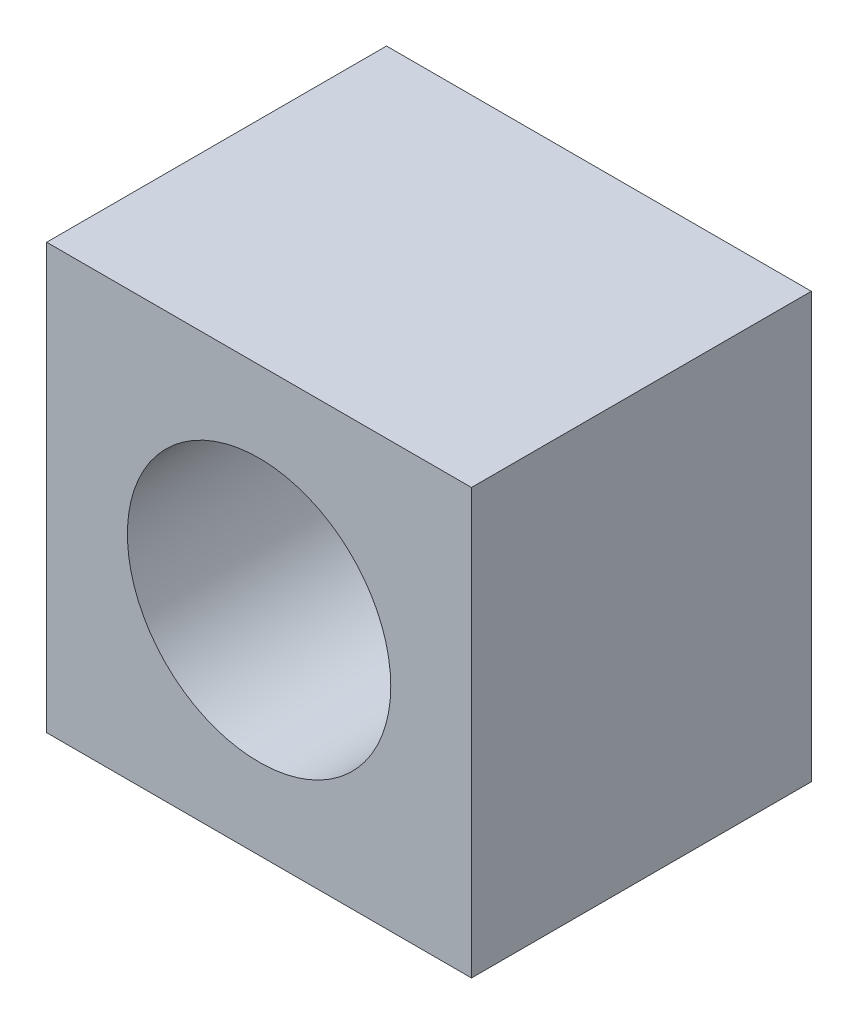
ISO-10303-21;
HEADER;
FILE_DESCRIPTION(('STEP AP214'),'2;1');
FILE_NAME('part.step','',(''),(''),'','','');
FILE_SCHEMA(('AUTOMOTIVE_DESIGN { 1 0 10303 214 1 1 1 1 }'));
ENDSEC;
DATA;
#1=APPLICATION_CONTEXT('core data for automotive mechanical design processes');
#2=APPLICATION_PROTOCOL_DEFINITION('international standard','automotive_design',2000,#1);
#3=PRODUCT_CONTEXT('',#1,'mechanical');
#4=PRODUCT('Part','Part','',(#3));
#5=PRODUCT_RELATED_PRODUCT_CATEGORY('part','',(#4));
#6=PRODUCT_DEFINITION_FORMATION('','',#4);
#7=PRODUCT_DEFINITION_CONTEXT('part definition',#1,'design');
#8=PRODUCT_DEFINITION('design','',#6,#7);
#9=PRODUCT_DEFINITION_SHAPE('','',#8);
#10=(LENGTH_UNIT() NAMED_UNIT(*) SI_UNIT(.MILLI.,.METRE.));
#11=(NAMED_UNIT(*) PLANE_ANGLE_UNIT() SI_UNIT($,.RADIAN.));
#12=(NAMED_UNIT(*) SI_UNIT($,.STERADIAN.) SOLID_ANGLE_UNIT());
#13=UNCERTAINTY_MEASURE_WITH_UNIT(LENGTH_MEASURE(1.E-05),#10,'distance_accuracy_value','');
#14=(GEOMETRIC_REPRESENTATION_CONTEXT(3) GLOBAL_UNCERTAINTY_ASSIGNED_CONTEXT((#13)) GLOBAL_UNIT_ASSIGNED_CONTEXT((#10,
#11,#12)) REPRESENTATION_CONTEXT('',''));
#15=CARTESIAN_POINT('',(0.,0.,0.));
#16=DIRECTION('',(0.,0.,1.));
#17=DIRECTION('',(1.,0.,0.));
#18=AXIS2_PLACEMENT_3D('',#15,#16,#17);
#19=CARTESIAN_POINT('',(0.,0.,8.));
#20=DIRECTION('',(0.,0.,-1.));
#21=DIRECTION('',(-1.,0.,0.));
#22=AXIS2_PLACEMENT_3D('',#19,#20,#21);
#23=CYLINDRICAL_SURFACE('',#22,1.25);
#24=CARTESIAN_POINT('',(0.,0.,0.));
#25=DIRECTION('',(0.,0.,1.));
#26=DIRECTION('',(1.,0.,0.));
#27=AXIS2_PLACEMENT_3D('',#24,#25,#26);
#28=CIRCLE('',#27,1.25);
#29=CARTESIAN_POINT('',(1.25,0.,0.));
#30=VERTEX_POINT('',#29);
#31=EDGE_CURVE('E102',#30,#30,#28,.T.);
#32=ORIENTED_EDGE('',*,*,#31,.F.);
#33=EDGE_LOOP('',(#32));
#34=FACE_BOUND('',#33,.T.);
#35=CARTESIAN_POINT('',(0.,0.,3.));
#36=DIRECTION('',(0.,0.,1.));
#37=DIRECTION('',(1.,0.,0.));
#38=AXIS2_PLACEMENT_3D('',#35,#36,#37);
#39=CIRCLE('',#38,1.25);
#40=CARTESIAN_POINT('',(1.25,0.,3.));
#41=VERTEX_POINT('',#40);
#42=EDGE_CURVE('E37',#41,#41,#39,.T.);
#43=ORIENTED_EDGE('',*,*,#42,.T.);
#44=EDGE_LOOP('',(#43));
#45=FACE_BOUND('',#44,.T.);
#46=ADVANCED_FACE('F33',(#34,#45),#23,.F.);
#47=CARTESIAN_POINT('',(0.,0.,8.));
#48=DIRECTION('',(0.,0.,-1.));
#49=DIRECTION('',(-1.,0.,0.));
#50=AXIS2_PLACEMENT_3D('',#47,#48,#49);
#51=PLANE('',#50);
#52=CARTESIAN_POINT('',(0.,0.,8.));
#53=DIRECTION('',(0.,0.,1.));
#54=DIRECTION('',(1.,0.,0.));
#55=AXIS2_PLACEMENT_3D('',#52,#53,#54);
#56=CIRCLE('',#55,3.1);
#57=CARTESIAN_POINT('',(3.1,0.,8.));
#58=VERTEX_POINT('',#57);
#59=EDGE_CURVE('E116',#58,#58,#56,.T.);
#60=ORIENTED_EDGE('',*,*,#59,.F.);
#61=EDGE_LOOP('',(#60));
#62=FACE_BOUND('',#61,.T.);
#63=DIRECTION('',(0.,1.,0.));
#64=VECTOR('',#63,1.);
#65=CARTESIAN_POINT('',(5.,-5.,8.));
#66=LINE('',#65,#64);
#67=CARTESIAN_POINT('',(5.,-5.,8.));
#68=VERTEX_POINT('',#67);
#69=CARTESIAN_POINT('',(5.,5.,8.));
#70=VERTEX_POINT('',#69);
#71=EDGE_CURVE('E86',#68,#70,#66,.T.);
#72=ORIENTED_EDGE('',*,*,#71,.T.);
#73=DIRECTION('',(-1.,0.,0.));
#74=VECTOR('',#73,1.);
#75=CARTESIAN_POINT('',(-5.,5.,8.));
#76=LINE('',#75,#74);
#77=CARTESIAN_POINT('',(-5.,5.,8.));
#78=VERTEX_POINT('',#77);
#79=EDGE_CURVE('E81',#70,#78,#76,.T.);
#80=ORIENTED_EDGE('',*,*,#79,.T.);
#81=DIRECTION('',(0.,-1.,0.));
#82=VECTOR('',#81,1.);
#83=CARTESIAN_POINT('',(-5.,-5.,8.));
#84=LINE('',#83,#82);
#85=CARTESIAN_POINT('',(-5.,-5.,8.));
#86=VERTEX_POINT('',#85);
#87=EDGE_CURVE('E84',#78,#86,#84,.T.);
#88=ORIENTED_EDGE('',*,*,#87,.T.);
#89=DIRECTION('',(1.,0.,0.));
#90=VECTOR('',#89,1.);
#91=CARTESIAN_POINT('',(-5.,-5.,8.));
#92=LINE('',#91,#90);
#93=EDGE_CURVE('E51',#86,#68,#92,.T.);
#94=ORIENTED_EDGE('',*,*,#93,.T.);
#95=EDGE_LOOP('',(#72,#80,#88,#94));
#96=FACE_BOUND('',#95,.T.);
#97=ADVANCED_FACE('F82',(#62,#96),#51,.F.);
#98=CARTESIAN_POINT('',(0.,0.,0.));
#99=DIRECTION('',(0.,0.,-1.));
#100=DIRECTION('',(-1.,0.,0.));
#101=AXIS2_PLACEMENT_3D('',#98,#99,#100);
#102=PLANE('',#101);
#103=DIRECTION('',(0.,1.,0.));
#104=VECTOR('',#103,1.);
#105=CARTESIAN_POINT('',(5.,-5.,0.));
#106=LINE('',#105,#104);
#107=CARTESIAN_POINT('',(5.,-5.,0.));
#108=VERTEX_POINT('',#107);
#109=CARTESIAN_POINT('',(5.,5.,0.));
#110=VERTEX_POINT('',#109);
#111=EDGE_CURVE('E99',#108,#110,#106,.T.);
#112=ORIENTED_EDGE('',*,*,#111,.F.);
#113=DIRECTION('',(1.,0.,0.));
#114=VECTOR('',#113,1.);
#115=CARTESIAN_POINT('',(-5.,-5.,0.));
#116=LINE('',#115,#114);
#117=CARTESIAN_POINT('',(-5.,-5.,0.));
#118=VERTEX_POINT('',#117);
#119=EDGE_CURVE('E74',#118,#108,#116,.T.);
#120=ORIENTED_EDGE('',*,*,#119,.F.);
#121=DIRECTION('',(0.,-1.,0.));
#122=VECTOR('',#121,1.);
#123=CARTESIAN_POINT('',(-5.,-5.,0.));
#124=LINE('',#123,#122);
#125=CARTESIAN_POINT('',(-5.,5.,0.));
#126=VERTEX_POINT('',#125);
#127=EDGE_CURVE('E68',#126,#118,#124,.T.);
#128=ORIENTED_EDGE('',*,*,#127,.F.);
#129=DIRECTION('',(-1.,0.,0.));
#130=VECTOR('',#129,1.);
#131=CARTESIAN_POINT('',(-5.,5.,0.));
#132=LINE('',#131,#130);
#133=EDGE_CURVE('E90',#110,#126,#132,.T.);
#134=ORIENTED_EDGE('',*,*,#133,.F.);
#135=EDGE_LOOP('',(#112,#120,#128,#134));
#136=FACE_BOUND('',#135,.T.);
#137=ORIENTED_EDGE('',*,*,#31,.T.);
#138=EDGE_LOOP('',(#137));
#139=FACE_BOUND('',#138,.T.);
#140=ADVANCED_FACE('F110',(#136,#139),#102,.T.);
#141=CARTESIAN_POINT('',(5.,-5.,8.));
#142=DIRECTION('',(-1.,0.,0.));
#143=DIRECTION('',(0.,0.,1.));
#144=AXIS2_PLACEMENT_3D('',#141,#142,#143);
#145=PLANE('',#144);
#146=ORIENTED_EDGE('',*,*,#111,.T.);
#147=DIRECTION('',(0.,0.,-1.));
#148=VECTOR('',#147,1.);
#149=CARTESIAN_POINT('',(5.,5.,8.));
#150=LINE('',#149,#148);
#151=EDGE_CURVE('E11',#70,#110,#150,.T.);
#152=ORIENTED_EDGE('',*,*,#151,.F.);
#153=ORIENTED_EDGE('',*,*,#71,.F.);
#154=DIRECTION('',(0.,0.,-1.));
#155=VECTOR('',#154,1.);
#156=CARTESIAN_POINT('',(5.,-5.,8.));
#157=LINE('',#156,#155);
#158=EDGE_CURVE('E95',#68,#108,#157,.T.);
#159=ORIENTED_EDGE('',*,*,#158,.T.);
#160=EDGE_LOOP('',(#146,#152,#153,#159));
#161=FACE_BOUND('',#160,.T.);
#162=ADVANCED_FACE('F35',(#161),#145,.F.);
#163=CARTESIAN_POINT('',(-5.,5.,8.));
#164=DIRECTION('',(0.,-1.,0.));
#165=DIRECTION('',(0.,0.,-1.));
#166=AXIS2_PLACEMENT_3D('',#163,#164,#165);
#167=PLANE('',#166);
#168=ORIENTED_EDGE('',*,*,#133,.T.);
#169=DIRECTION('',(0.,0.,-1.));
#170=VECTOR('',#169,1.);
#171=CARTESIAN_POINT('',(-5.,5.,8.));
#172=LINE('',#171,#170);
#173=EDGE_CURVE('E43',#78,#126,#172,.T.);
#174=ORIENTED_EDGE('',*,*,#173,.F.);
#175=ORIENTED_EDGE('',*,*,#79,.F.);
#176=ORIENTED_EDGE('',*,*,#151,.T.);
#177=EDGE_LOOP('',(#168,#174,#175,#176));
#178=FACE_BOUND('',#177,.T.);
#179=ADVANCED_FACE('F89',(#178),#167,.F.);
#180=CARTESIAN_POINT('',(-5.,-5.,8.));
#181=DIRECTION('',(1.,0.,0.));
#182=DIRECTION('',(0.,0.,-1.));
#183=AXIS2_PLACEMENT_3D('',#180,#181,#182);
#184=PLANE('',#183);
#185=ORIENTED_EDGE('',*,*,#127,.T.);
#186=DIRECTION('',(0.,0.,-1.));
#187=VECTOR('',#186,1.);
#188=CARTESIAN_POINT('',(-5.,-5.,8.));
#189=LINE('',#188,#187);
#190=EDGE_CURVE('E91',#86,#118,#189,.T.);
#191=ORIENTED_EDGE('',*,*,#190,.F.);
#192=ORIENTED_EDGE('',*,*,#87,.F.);
#193=ORIENTED_EDGE('',*,*,#173,.T.);
#194=EDGE_LOOP('',(#185,#191,#192,#193));
#195=FACE_BOUND('',#194,.T.);
#196=ADVANCED_FACE('F93',(#195),#184,.F.);
#197=CARTESIAN_POINT('',(-5.,-5.,8.));
#198=DIRECTION('',(0.,1.,0.));
#199=DIRECTION('',(0.,0.,1.));
#200=AXIS2_PLACEMENT_3D('',#197,#198,#199);
#201=PLANE('',#200);
#202=ORIENTED_EDGE('',*,*,#119,.T.);
#203=ORIENTED_EDGE('',*,*,#158,.F.);
#204=ORIENTED_EDGE('',*,*,#93,.F.);
#205=ORIENTED_EDGE('',*,*,#190,.T.);
#206=EDGE_LOOP('',(#202,#203,#204,#205));
#207=FACE_BOUND('',#206,.T.);
#208=ADVANCED_FACE('F107',(#207),#201,.F.);
#209=CARTESIAN_POINT('',(0.,0.,3.));
#210=DIRECTION('',(0.,0.,1.));
#211=DIRECTION('',(1.,0.,0.));
#212=AXIS2_PLACEMENT_3D('',#209,#210,#211);
#213=CYLINDRICAL_SURFACE('',#212,3.1);
#214=CARTESIAN_POINT('',(0.,0.,3.));
#215=DIRECTION('',(0.,0.,1.));
#216=DIRECTION('',(1.,0.,0.));
#217=AXIS2_PLACEMENT_3D('',#214,#215,#216);
#218=CIRCLE('',#217,3.1);
#219=CARTESIAN_POINT('',(3.1,0.,3.));
#220=VERTEX_POINT('',#219);
#221=EDGE_CURVE('E119',#220,#220,#218,.T.);
#222=ORIENTED_EDGE('',*,*,#221,.F.);
#223=EDGE_LOOP('',(#222));
#224=FACE_BOUND('',#223,.T.);
#225=ORIENTED_EDGE('',*,*,#59,.T.);
#226=EDGE_LOOP('',(#225));
#227=FACE_BOUND('',#226,.T.);
#228=ADVANCED_FACE('F129',(#224,#227),#213,.F.);
#229=CARTESIAN_POINT('',(0.,0.,3.));
#230=DIRECTION('',(0.,0.,1.));
#231=DIRECTION('',(1.,0.,0.));
#232=AXIS2_PLACEMENT_3D('',#229,#230,#231);
#233=PLANE('',#232);
#234=ORIENTED_EDGE('',*,*,#42,.F.);
#235=EDGE_LOOP('',(#234));
#236=FACE_BOUND('',#235,.T.);
#237=ORIENTED_EDGE('',*,*,#221,.T.);
#238=EDGE_LOOP('',(#237));
#239=FACE_BOUND('',#238,.T.);
#240=ADVANCED_FACE('F127',(#236,#239),#233,.T.);
#241=CLOSED_SHELL('',(#46,#97,#140,#162,#179,#196,#208,#228,#240));
#242=MANIFOLD_SOLID_BREP('B2',#241);
#243=ADVANCED_BREP_SHAPE_REPRESENTATION('',(#18,#242),#14);
#244=SHAPE_DEFINITION_REPRESENTATION(#9,#243);
ENDSEC;
END-ISO-10303-21;
